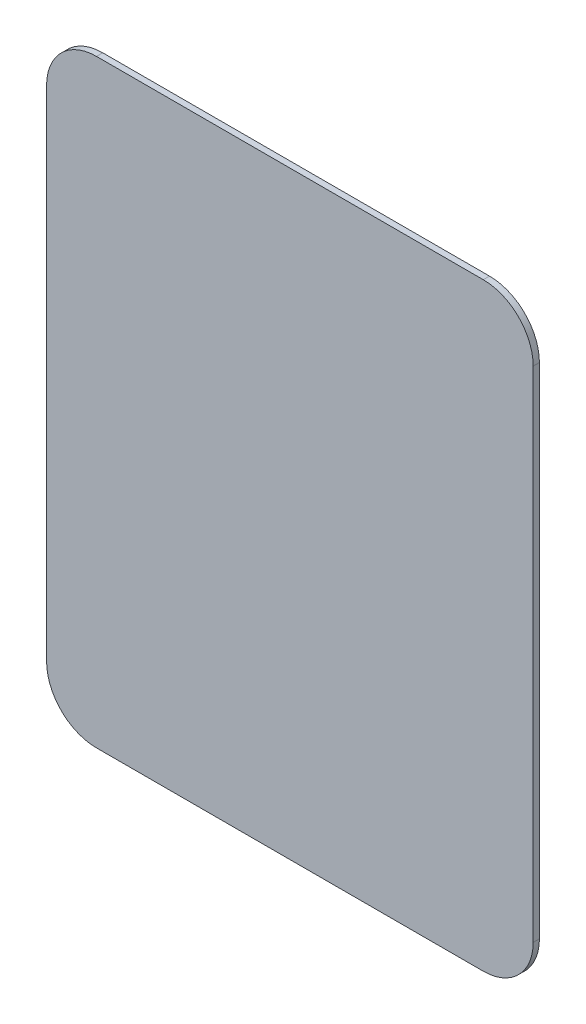
ISO-10303-21;
HEADER;
FILE_DESCRIPTION(('STEP AP214'),'2;1');
FILE_NAME('part.step','',(''),(''),'','','');
FILE_SCHEMA(('AUTOMOTIVE_DESIGN { 1 0 10303 214 1 1 1 1 }'));
ENDSEC;
DATA;
#1=APPLICATION_CONTEXT('core data for automotive mechanical design processes');
#2=APPLICATION_PROTOCOL_DEFINITION('international standard','automotive_design',2000,#1);
#3=PRODUCT_CONTEXT('',#1,'mechanical');
#4=PRODUCT('Part','Part','',(#3));
#5=PRODUCT_RELATED_PRODUCT_CATEGORY('part','',(#4));
#6=PRODUCT_DEFINITION_FORMATION('','',#4);
#7=PRODUCT_DEFINITION_CONTEXT('part definition',#1,'design');
#8=PRODUCT_DEFINITION('design','',#6,#7);
#9=PRODUCT_DEFINITION_SHAPE('','',#8);
#10=(LENGTH_UNIT() NAMED_UNIT(*) SI_UNIT(.MILLI.,.METRE.));
#11=(NAMED_UNIT(*) PLANE_ANGLE_UNIT() SI_UNIT($,.RADIAN.));
#12=(NAMED_UNIT(*) SI_UNIT($,.STERADIAN.) SOLID_ANGLE_UNIT());
#13=UNCERTAINTY_MEASURE_WITH_UNIT(LENGTH_MEASURE(1.E-05),#10,'distance_accuracy_value','');
#14=(GEOMETRIC_REPRESENTATION_CONTEXT(3) GLOBAL_UNCERTAINTY_ASSIGNED_CONTEXT((#13)) GLOBAL_UNIT_ASSIGNED_CONTEXT((#10,
#11,#12)) REPRESENTATION_CONTEXT('',''));
#15=CARTESIAN_POINT('',(0.,0.,0.));
#16=DIRECTION('',(0.,0.,1.));
#17=DIRECTION('',(1.,0.,0.));
#18=AXIS2_PLACEMENT_3D('',#15,#16,#17);
#19=CARTESIAN_POINT('',(-98.4249999999999,-127.,3.175));
#20=DIRECTION('',(0.,0.,-1.));
#21=DIRECTION('',(-1.,0.,0.));
#22=AXIS2_PLACEMENT_3D('',#19,#20,#21);
#23=CYLINDRICAL_SURFACE('',#22,25.4);
#24=CARTESIAN_POINT('',(-98.4249999999999,-127.,0.));
#25=DIRECTION('',(0.,0.,1.));
#26=DIRECTION('',(-1.,0.,0.));
#27=AXIS2_PLACEMENT_3D('',#24,#25,#26);
#28=CIRCLE('',#27,25.4);
#29=CARTESIAN_POINT('',(-123.825,-127.,0.));
#30=VERTEX_POINT('',#29);
#31=CARTESIAN_POINT('',(-98.4249999999998,-152.4,0.));
#32=VERTEX_POINT('',#31);
#33=EDGE_CURVE('E137',#30,#32,#28,.T.);
#34=ORIENTED_EDGE('',*,*,#33,.T.);
#35=DIRECTION('',(0.,0.,-1.));
#36=VECTOR('',#35,1.);
#37=CARTESIAN_POINT('',(-98.4249999999998,-152.4,3.175));
#38=LINE('',#37,#36);
#39=CARTESIAN_POINT('',(-98.4249999999998,-152.4,3.175));
#40=VERTEX_POINT('',#39);
#41=EDGE_CURVE('E11',#40,#32,#38,.T.);
#42=ORIENTED_EDGE('',*,*,#41,.F.);
#43=CARTESIAN_POINT('',(-98.4249999999999,-127.,3.175));
#44=DIRECTION('',(0.,0.,1.));
#45=DIRECTION('',(-1.,0.,0.));
#46=AXIS2_PLACEMENT_3D('',#43,#44,#45);
#47=CIRCLE('',#46,25.4);
#48=CARTESIAN_POINT('',(-123.825,-127.,3.175));
#49=VERTEX_POINT('',#48);
#50=EDGE_CURVE('E151',#49,#40,#47,.T.);
#51=ORIENTED_EDGE('',*,*,#50,.F.);
#52=DIRECTION('',(0.,0.,-1.));
#53=VECTOR('',#52,1.);
#54=CARTESIAN_POINT('',(-123.825,-127.,3.175));
#55=LINE('',#54,#53);
#56=EDGE_CURVE('E133',#49,#30,#55,.T.);
#57=ORIENTED_EDGE('',*,*,#56,.T.);
#58=EDGE_LOOP('',(#34,#42,#51,#57));
#59=FACE_BOUND('',#58,.T.);
#60=ADVANCED_FACE('F41',(#59),#23,.T.);
#61=CARTESIAN_POINT('',(-98.4249999999998,-152.4,3.175));
#62=DIRECTION('',(0.,1.,0.));
#63=DIRECTION('',(0.,0.,1.));
#64=AXIS2_PLACEMENT_3D('',#61,#62,#63);
#65=PLANE('',#64);
#66=DIRECTION('',(1.,0.,0.));
#67=VECTOR('',#66,1.);
#68=CARTESIAN_POINT('',(-98.4249999999998,-152.4,0.));
#69=LINE('',#68,#67);
#70=CARTESIAN_POINT('',(98.4249999999998,-152.4,0.));
#71=VERTEX_POINT('',#70);
#72=EDGE_CURVE('E140',#32,#71,#69,.T.);
#73=ORIENTED_EDGE('',*,*,#72,.T.);
#74=DIRECTION('',(0.,0.,-1.));
#75=VECTOR('',#74,1.);
#76=CARTESIAN_POINT('',(98.4249999999998,-152.4,3.175));
#77=LINE('',#76,#75);
#78=CARTESIAN_POINT('',(98.4249999999998,-152.4,3.175));
#79=VERTEX_POINT('',#78);
#80=EDGE_CURVE('E49',#79,#71,#77,.T.);
#81=ORIENTED_EDGE('',*,*,#80,.F.);
#82=DIRECTION('',(1.,0.,0.));
#83=VECTOR('',#82,1.);
#84=CARTESIAN_POINT('',(-98.4249999999998,-152.4,3.175));
#85=LINE('',#84,#83);
#86=EDGE_CURVE('E100',#40,#79,#85,.T.);
#87=ORIENTED_EDGE('',*,*,#86,.F.);
#88=ORIENTED_EDGE('',*,*,#41,.T.);
#89=EDGE_LOOP('',(#73,#81,#87,#88));
#90=FACE_BOUND('',#89,.T.);
#91=ADVANCED_FACE('F186',(#90),#65,.F.);
#92=CARTESIAN_POINT('',(98.425,-127.,3.175));
#93=DIRECTION('',(0.,0.,-1.));
#94=DIRECTION('',(-1.,0.,0.));
#95=AXIS2_PLACEMENT_3D('',#92,#93,#94);
#96=CYLINDRICAL_SURFACE('',#95,25.4);
#97=CARTESIAN_POINT('',(98.425,-127.,0.));
#98=DIRECTION('',(0.,0.,1.));
#99=DIRECTION('',(1.,0.,0.));
#100=AXIS2_PLACEMENT_3D('',#97,#98,#99);
#101=CIRCLE('',#100,25.4);
#102=CARTESIAN_POINT('',(123.825,-127.,0.));
#103=VERTEX_POINT('',#102);
#104=EDGE_CURVE('E142',#71,#103,#101,.T.);
#105=ORIENTED_EDGE('',*,*,#104,.T.);
#106=DIRECTION('',(0.,0.,-1.));
#107=VECTOR('',#106,1.);
#108=CARTESIAN_POINT('',(123.825,-127.,3.175));
#109=LINE('',#108,#107);
#110=CARTESIAN_POINT('',(123.825,-127.,3.175));
#111=VERTEX_POINT('',#110);
#112=EDGE_CURVE('E158',#111,#103,#109,.T.);
#113=ORIENTED_EDGE('',*,*,#112,.F.);
#114=CARTESIAN_POINT('',(98.425,-127.,3.175));
#115=DIRECTION('',(0.,0.,1.));
#116=DIRECTION('',(1.,0.,0.));
#117=AXIS2_PLACEMENT_3D('',#114,#115,#116);
#118=CIRCLE('',#117,25.4);
#119=EDGE_CURVE('E166',#79,#111,#118,.T.);
#120=ORIENTED_EDGE('',*,*,#119,.F.);
#121=ORIENTED_EDGE('',*,*,#80,.T.);
#122=EDGE_LOOP('',(#105,#113,#120,#121));
#123=FACE_BOUND('',#122,.T.);
#124=ADVANCED_FACE('F164',(#123),#96,.T.);
#125=CARTESIAN_POINT('',(123.825,-127.,3.175));
#126=DIRECTION('',(-1.,0.,0.));
#127=DIRECTION('',(0.,0.,1.));
#128=AXIS2_PLACEMENT_3D('',#125,#126,#127);
#129=PLANE('',#128);
#130=DIRECTION('',(0.,1.,0.));
#131=VECTOR('',#130,1.);
#132=CARTESIAN_POINT('',(123.825,-127.,0.));
#133=LINE('',#132,#131);
#134=CARTESIAN_POINT('',(123.825,127.,0.));
#135=VERTEX_POINT('',#134);
#136=EDGE_CURVE('E144',#103,#135,#133,.T.);
#137=ORIENTED_EDGE('',*,*,#136,.T.);
#138=DIRECTION('',(0.,0.,-1.));
#139=VECTOR('',#138,1.);
#140=CARTESIAN_POINT('',(123.825,127.,3.175));
#141=LINE('',#140,#139);
#142=CARTESIAN_POINT('',(123.825,127.,3.175));
#143=VERTEX_POINT('',#142);
#144=EDGE_CURVE('E155',#143,#135,#141,.T.);
#145=ORIENTED_EDGE('',*,*,#144,.F.);
#146=DIRECTION('',(0.,1.,0.));
#147=VECTOR('',#146,1.);
#148=CARTESIAN_POINT('',(123.825,-127.,3.175));
#149=LINE('',#148,#147);
#150=EDGE_CURVE('E178',#111,#143,#149,.T.);
#151=ORIENTED_EDGE('',*,*,#150,.F.);
#152=ORIENTED_EDGE('',*,*,#112,.T.);
#153=EDGE_LOOP('',(#137,#145,#151,#152));
#154=FACE_BOUND('',#153,.T.);
#155=ADVANCED_FACE('F174',(#154),#129,.F.);
#156=CARTESIAN_POINT('',(98.425,127.,3.175));
#157=DIRECTION('',(0.,0.,-1.));
#158=DIRECTION('',(-1.,0.,0.));
#159=AXIS2_PLACEMENT_3D('',#156,#157,#158);
#160=CYLINDRICAL_SURFACE('',#159,25.4);
#161=CARTESIAN_POINT('',(98.425,127.,0.));
#162=DIRECTION('',(0.,0.,1.));
#163=DIRECTION('',(-1.,0.,0.));
#164=AXIS2_PLACEMENT_3D('',#161,#162,#163);
#165=CIRCLE('',#164,25.4);
#166=CARTESIAN_POINT('',(98.4249999999998,152.4,0.));
#167=VERTEX_POINT('',#166);
#168=EDGE_CURVE('E146',#135,#167,#165,.T.);
#169=ORIENTED_EDGE('',*,*,#168,.T.);
#170=DIRECTION('',(0.,0.,-1.));
#171=VECTOR('',#170,1.);
#172=CARTESIAN_POINT('',(98.4249999999998,152.4,3.175));
#173=LINE('',#172,#171);
#174=CARTESIAN_POINT('',(98.4249999999998,152.4,3.175));
#175=VERTEX_POINT('',#174);
#176=EDGE_CURVE('E128',#175,#167,#173,.T.);
#177=ORIENTED_EDGE('',*,*,#176,.F.);
#178=CARTESIAN_POINT('',(98.425,127.,3.175));
#179=DIRECTION('',(0.,0.,1.));
#180=DIRECTION('',(-1.,0.,0.));
#181=AXIS2_PLACEMENT_3D('',#178,#179,#180);
#182=CIRCLE('',#181,25.4);
#183=EDGE_CURVE('E119',#143,#175,#182,.T.);
#184=ORIENTED_EDGE('',*,*,#183,.F.);
#185=ORIENTED_EDGE('',*,*,#144,.T.);
#186=EDGE_LOOP('',(#169,#177,#184,#185));
#187=FACE_BOUND('',#186,.T.);
#188=ADVANCED_FACE('F177',(#187),#160,.T.);
#189=CARTESIAN_POINT('',(-98.4249999999998,152.4,3.175));
#190=DIRECTION('',(0.,-1.,0.));
#191=DIRECTION('',(0.,0.,-1.));
#192=AXIS2_PLACEMENT_3D('',#189,#190,#191);
#193=PLANE('',#192);
#194=DIRECTION('',(-1.,0.,0.));
#195=VECTOR('',#194,1.);
#196=CARTESIAN_POINT('',(-98.4249999999998,152.4,0.));
#197=LINE('',#196,#195);
#198=CARTESIAN_POINT('',(-98.4249999999998,152.4,0.));
#199=VERTEX_POINT('',#198);
#200=EDGE_CURVE('E127',#167,#199,#197,.T.);
#201=ORIENTED_EDGE('',*,*,#200,.T.);
#202=DIRECTION('',(0.,0.,-1.));
#203=VECTOR('',#202,1.);
#204=CARTESIAN_POINT('',(-98.4249999999998,152.4,3.175));
#205=LINE('',#204,#203);
#206=CARTESIAN_POINT('',(-98.4249999999998,152.4,3.175));
#207=VERTEX_POINT('',#206);
#208=EDGE_CURVE('E124',#207,#199,#205,.T.);
#209=ORIENTED_EDGE('',*,*,#208,.F.);
#210=DIRECTION('',(-1.,0.,0.));
#211=VECTOR('',#210,1.);
#212=CARTESIAN_POINT('',(-98.4249999999998,152.4,3.175));
#213=LINE('',#212,#211);
#214=EDGE_CURVE('E113',#175,#207,#213,.T.);
#215=ORIENTED_EDGE('',*,*,#214,.F.);
#216=ORIENTED_EDGE('',*,*,#176,.T.);
#217=EDGE_LOOP('',(#201,#209,#215,#216));
#218=FACE_BOUND('',#217,.T.);
#219=ADVANCED_FACE('F125',(#218),#193,.F.);
#220=CARTESIAN_POINT('',(-98.4249999999999,127.,3.175));
#221=DIRECTION('',(0.,0.,-1.));
#222=DIRECTION('',(-1.,0.,0.));
#223=AXIS2_PLACEMENT_3D('',#220,#221,#222);
#224=CYLINDRICAL_SURFACE('',#223,25.4);
#225=CARTESIAN_POINT('',(-98.4249999999999,127.,0.));
#226=DIRECTION('',(0.,0.,1.));
#227=DIRECTION('',(-1.,0.,0.));
#228=AXIS2_PLACEMENT_3D('',#225,#226,#227);
#229=CIRCLE('',#228,25.4);
#230=CARTESIAN_POINT('',(-123.825,127.,0.));
#231=VERTEX_POINT('',#230);
#232=EDGE_CURVE('E86',#199,#231,#229,.T.);
#233=ORIENTED_EDGE('',*,*,#232,.T.);
#234=DIRECTION('',(0.,0.,-1.));
#235=VECTOR('',#234,1.);
#236=CARTESIAN_POINT('',(-123.825,127.,3.175));
#237=LINE('',#236,#235);
#238=CARTESIAN_POINT('',(-123.825,127.,3.175));
#239=VERTEX_POINT('',#238);
#240=EDGE_CURVE('E129',#239,#231,#237,.T.);
#241=ORIENTED_EDGE('',*,*,#240,.F.);
#242=CARTESIAN_POINT('',(-98.4249999999999,127.,3.175));
#243=DIRECTION('',(0.,0.,1.));
#244=DIRECTION('',(-1.,0.,0.));
#245=AXIS2_PLACEMENT_3D('',#242,#243,#244);
#246=CIRCLE('',#245,25.4);
#247=EDGE_CURVE('E117',#207,#239,#246,.T.);
#248=ORIENTED_EDGE('',*,*,#247,.F.);
#249=ORIENTED_EDGE('',*,*,#208,.T.);
#250=EDGE_LOOP('',(#233,#241,#248,#249));
#251=FACE_BOUND('',#250,.T.);
#252=ADVANCED_FACE('F131',(#251),#224,.T.);
#253=CARTESIAN_POINT('',(-123.825,-127.,3.175));
#254=DIRECTION('',(1.,0.,0.));
#255=DIRECTION('',(0.,0.,-1.));
#256=AXIS2_PLACEMENT_3D('',#253,#254,#255);
#257=PLANE('',#256);
#258=DIRECTION('',(0.,-1.,0.));
#259=VECTOR('',#258,1.);
#260=CARTESIAN_POINT('',(-123.825,-127.,0.));
#261=LINE('',#260,#259);
#262=EDGE_CURVE('E92',#231,#30,#261,.T.);
#263=ORIENTED_EDGE('',*,*,#262,.T.);
#264=ORIENTED_EDGE('',*,*,#56,.F.);
#265=DIRECTION('',(0.,-1.,0.));
#266=VECTOR('',#265,1.);
#267=CARTESIAN_POINT('',(-123.825,-127.,3.175));
#268=LINE('',#267,#266);
#269=EDGE_CURVE('E57',#239,#49,#268,.T.);
#270=ORIENTED_EDGE('',*,*,#269,.F.);
#271=ORIENTED_EDGE('',*,*,#240,.T.);
#272=EDGE_LOOP('',(#263,#264,#270,#271));
#273=FACE_BOUND('',#272,.T.);
#274=ADVANCED_FACE('F202',(#273),#257,.F.);
#275=CARTESIAN_POINT('',(-98.4249999999999,-127.,3.175));
#276=DIRECTION('',(0.,0.,-1.));
#277=DIRECTION('',(-1.,0.,0.));
#278=AXIS2_PLACEMENT_3D('',#275,#276,#277);
#279=PLANE('',#278);
#280=ORIENTED_EDGE('',*,*,#50,.T.);
#281=ORIENTED_EDGE('',*,*,#86,.T.);
#282=ORIENTED_EDGE('',*,*,#119,.T.);
#283=ORIENTED_EDGE('',*,*,#150,.T.);
#284=ORIENTED_EDGE('',*,*,#183,.T.);
#285=ORIENTED_EDGE('',*,*,#214,.T.);
#286=ORIENTED_EDGE('',*,*,#247,.T.);
#287=ORIENTED_EDGE('',*,*,#269,.T.);
#288=EDGE_LOOP('',(#280,#281,#282,#283,#284,#285,#286,#287));
#289=FACE_BOUND('',#288,.T.);
#290=ADVANCED_FACE('F115',(#289),#279,.F.);
#291=CARTESIAN_POINT('',(-98.4249999999999,-127.,0.));
#292=DIRECTION('',(0.,0.,-1.));
#293=DIRECTION('',(-1.,0.,0.));
#294=AXIS2_PLACEMENT_3D('',#291,#292,#293);
#295=PLANE('',#294);
#296=ORIENTED_EDGE('',*,*,#33,.F.);
#297=ORIENTED_EDGE('',*,*,#262,.F.);
#298=ORIENTED_EDGE('',*,*,#232,.F.);
#299=ORIENTED_EDGE('',*,*,#200,.F.);
#300=ORIENTED_EDGE('',*,*,#168,.F.);
#301=ORIENTED_EDGE('',*,*,#136,.F.);
#302=ORIENTED_EDGE('',*,*,#104,.F.);
#303=ORIENTED_EDGE('',*,*,#72,.F.);
#304=EDGE_LOOP('',(#296,#297,#298,#299,#300,#301,#302,#303));
#305=FACE_BOUND('',#304,.T.);
#306=ADVANCED_FACE('F170',(#305),#295,.T.);
#307=CLOSED_SHELL('',(#60,#91,#124,#155,#188,#219,#252,#274,#290,#306));
#308=MANIFOLD_SOLID_BREP('B2',#307);
#309=ADVANCED_BREP_SHAPE_REPRESENTATION('',(#18,#308),#14);
#310=SHAPE_DEFINITION_REPRESENTATION(#9,#309);
ENDSEC;
END-ISO-10303-21;
